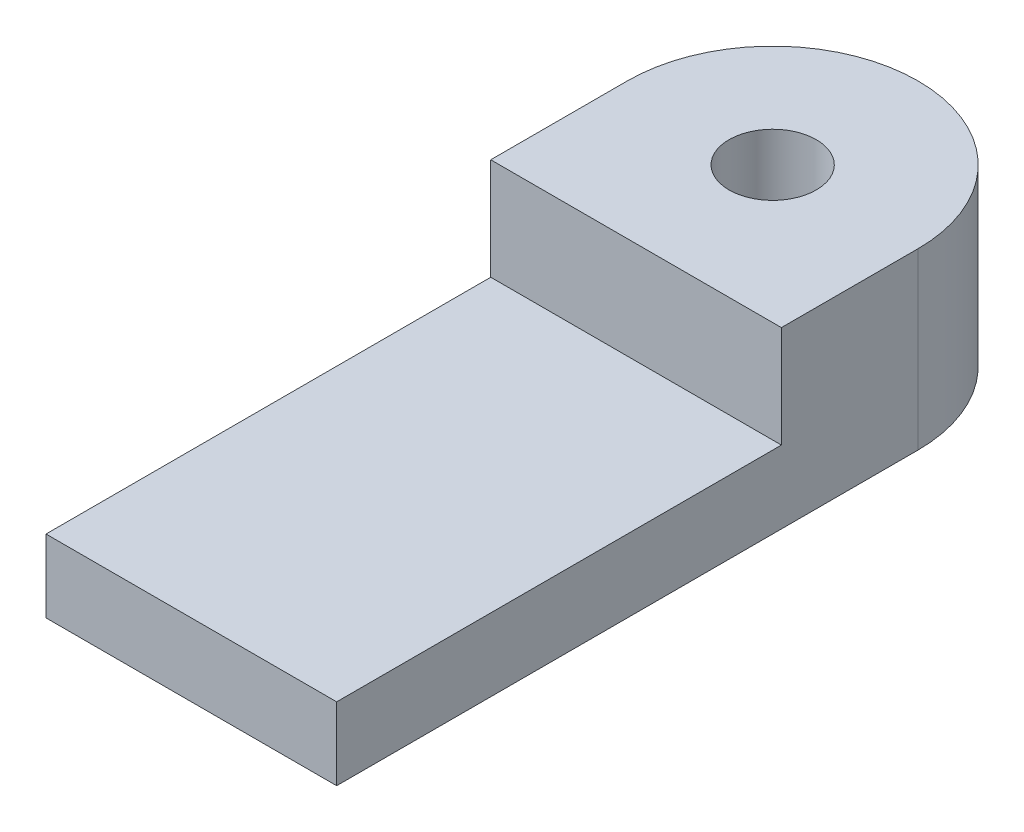
ISO-10303-21;
HEADER;
FILE_DESCRIPTION(('STEP AP214'),'2;1');
FILE_NAME('part.step','',(''),(''),'','','');
FILE_SCHEMA(('AUTOMOTIVE_DESIGN { 1 0 10303 214 1 1 1 1 }'));
ENDSEC;
DATA;
#1=APPLICATION_CONTEXT('core data for automotive mechanical design processes');
#2=APPLICATION_PROTOCOL_DEFINITION('international standard','automotive_design',2000,#1);
#3=PRODUCT_CONTEXT('',#1,'mechanical');
#4=PRODUCT('Part','Part','',(#3));
#5=PRODUCT_RELATED_PRODUCT_CATEGORY('part','',(#4));
#6=PRODUCT_DEFINITION_FORMATION('','',#4);
#7=PRODUCT_DEFINITION_CONTEXT('part definition',#1,'design');
#8=PRODUCT_DEFINITION('design','',#6,#7);
#9=PRODUCT_DEFINITION_SHAPE('','',#8);
#10=(LENGTH_UNIT() NAMED_UNIT(*) SI_UNIT(.MILLI.,.METRE.));
#11=(NAMED_UNIT(*) PLANE_ANGLE_UNIT() SI_UNIT($,.RADIAN.));
#12=(NAMED_UNIT(*) SI_UNIT($,.STERADIAN.) SOLID_ANGLE_UNIT());
#13=UNCERTAINTY_MEASURE_WITH_UNIT(LENGTH_MEASURE(1.E-05),#10,'distance_accuracy_value','');
#14=(GEOMETRIC_REPRESENTATION_CONTEXT(3) GLOBAL_UNCERTAINTY_ASSIGNED_CONTEXT((#13)) GLOBAL_UNIT_ASSIGNED_CONTEXT((#10,
#11,#12)) REPRESENTATION_CONTEXT('',''));
#15=CARTESIAN_POINT('',(0.,0.,0.));
#16=DIRECTION('',(0.,0.,1.));
#17=DIRECTION('',(1.,0.,0.));
#18=AXIS2_PLACEMENT_3D('',#15,#16,#17);
#19=CARTESIAN_POINT('',(5.,2.5,-20.));
#20=DIRECTION('',(0.,-1.,0.));
#21=DIRECTION('',(0.,0.,-1.));
#22=AXIS2_PLACEMENT_3D('',#19,#20,#21);
#23=PLANE('',#22);
#24=DIRECTION('',(1.,0.,0.));
#25=VECTOR('',#24,1.);
#26=CARTESIAN_POINT('',(0.,2.5,-15.3));
#27=LINE('',#26,#25);
#28=CARTESIAN_POINT('',(0.,2.5,-15.3));
#29=VERTEX_POINT('',#28);
#30=CARTESIAN_POINT('',(10.,2.5,-15.3));
#31=VERTEX_POINT('',#30);
#32=EDGE_CURVE('E59',#29,#31,#27,.T.);
#33=ORIENTED_EDGE('',*,*,#32,.F.);
#34=DIRECTION('',(0.,0.,1.));
#35=VECTOR('',#34,1.);
#36=CARTESIAN_POINT('',(0.,2.5,0.));
#37=LINE('',#36,#35);
#38=CARTESIAN_POINT('',(0.,2.5,0.));
#39=VERTEX_POINT('',#38);
#40=EDGE_CURVE('E64',#29,#39,#37,.T.);
#41=ORIENTED_EDGE('',*,*,#40,.T.);
#42=DIRECTION('',(1.,0.,0.));
#43=VECTOR('',#42,1.);
#44=CARTESIAN_POINT('',(10.,2.5,0.));
#45=LINE('',#44,#43);
#46=CARTESIAN_POINT('',(10.,2.5,0.));
#47=VERTEX_POINT('',#46);
#48=EDGE_CURVE('E96',#39,#47,#45,.T.);
#49=ORIENTED_EDGE('',*,*,#48,.T.);
#50=DIRECTION('',(0.,0.,-1.));
#51=VECTOR('',#50,1.);
#52=CARTESIAN_POINT('',(10.,2.5,-20.));
#53=LINE('',#52,#51);
#54=EDGE_CURVE('E159',#47,#31,#53,.T.);
#55=ORIENTED_EDGE('',*,*,#54,.T.);
#56=EDGE_LOOP('',(#33,#41,#49,#55));
#57=FACE_BOUND('',#56,.T.);
#58=ADVANCED_FACE('F43',(#57),#23,.F.);
#59=CARTESIAN_POINT('',(10.,2.5,0.));
#60=DIRECTION('',(0.,0.,-1.));
#61=DIRECTION('',(-1.,0.,0.));
#62=AXIS2_PLACEMENT_3D('',#59,#60,#61);
#63=PLANE('',#62);
#64=DIRECTION('',(1.,0.,0.));
#65=VECTOR('',#64,1.);
#66=CARTESIAN_POINT('',(10.,0.,0.));
#67=LINE('',#66,#65);
#68=CARTESIAN_POINT('',(0.,0.,0.));
#69=VERTEX_POINT('',#68);
#70=CARTESIAN_POINT('',(10.,0.,0.));
#71=VERTEX_POINT('',#70);
#72=EDGE_CURVE('E102',#69,#71,#67,.T.);
#73=ORIENTED_EDGE('',*,*,#72,.T.);
#74=DIRECTION('',(0.,-1.,0.));
#75=VECTOR('',#74,1.);
#76=CARTESIAN_POINT('',(10.,2.5,0.));
#77=LINE('',#76,#75);
#78=EDGE_CURVE('E11',#47,#71,#77,.T.);
#79=ORIENTED_EDGE('',*,*,#78,.F.);
#80=ORIENTED_EDGE('',*,*,#48,.F.);
#81=DIRECTION('',(0.,-1.,0.));
#82=VECTOR('',#81,1.);
#83=CARTESIAN_POINT('',(0.,2.5,0.));
#84=LINE('',#83,#82);
#85=EDGE_CURVE('E87',#39,#69,#84,.T.);
#86=ORIENTED_EDGE('',*,*,#85,.T.);
#87=EDGE_LOOP('',(#73,#79,#80,#86));
#88=FACE_BOUND('',#87,.T.);
#89=ADVANCED_FACE('F45',(#88),#63,.F.);
#90=CARTESIAN_POINT('',(10.,2.5,-20.));
#91=DIRECTION('',(-1.,0.,0.));
#92=DIRECTION('',(0.,0.,1.));
#93=AXIS2_PLACEMENT_3D('',#90,#91,#92);
#94=PLANE('',#93);
#95=DIRECTION('',(0.,0.,-1.));
#96=VECTOR('',#95,1.);
#97=CARTESIAN_POINT('',(10.,0.,-20.));
#98=LINE('',#97,#96);
#99=CARTESIAN_POINT('',(10.,0.,-20.));
#100=VERTEX_POINT('',#99);
#101=EDGE_CURVE('E106',#71,#100,#98,.T.);
#102=ORIENTED_EDGE('',*,*,#101,.T.);
#103=DIRECTION('',(0.,-1.,0.));
#104=VECTOR('',#103,1.);
#105=CARTESIAN_POINT('',(10.,2.5,-20.));
#106=LINE('',#105,#104);
#107=CARTESIAN_POINT('',(10.,6.,-20.));
#108=VERTEX_POINT('',#107);
#109=EDGE_CURVE('E52',#108,#100,#106,.T.);
#110=ORIENTED_EDGE('',*,*,#109,.F.);
#111=DIRECTION('',(0.,0.,-1.));
#112=VECTOR('',#111,1.);
#113=CARTESIAN_POINT('',(10.,6.,-15.3));
#114=LINE('',#113,#112);
#115=CARTESIAN_POINT('',(10.,6.,-15.3));
#116=VERTEX_POINT('',#115);
#117=EDGE_CURVE('E136',#116,#108,#114,.T.);
#118=ORIENTED_EDGE('',*,*,#117,.F.);
#119=DIRECTION('',(0.,-1.,0.));
#120=VECTOR('',#119,1.);
#121=CARTESIAN_POINT('',(10.,6.,-15.3));
#122=LINE('',#121,#120);
#123=EDGE_CURVE('E114',#116,#31,#122,.T.);
#124=ORIENTED_EDGE('',*,*,#123,.T.);
#125=ORIENTED_EDGE('',*,*,#54,.F.);
#126=ORIENTED_EDGE('',*,*,#78,.T.);
#127=EDGE_LOOP('',(#102,#110,#118,#124,#125,#126));
#128=FACE_BOUND('',#127,.T.);
#129=ADVANCED_FACE('F133',(#128),#94,.F.);
#130=CARTESIAN_POINT('',(5.,2.5,-20.));
#131=DIRECTION('',(0.,-1.,0.));
#132=DIRECTION('',(0.,0.,-1.));
#133=AXIS2_PLACEMENT_3D('',#130,#131,#132);
#134=CYLINDRICAL_SURFACE('',#133,5.);
#135=CARTESIAN_POINT('',(5.,0.,-20.));
#136=DIRECTION('',(0.,1.,0.));
#137=DIRECTION('',(0.,0.,-1.));
#138=AXIS2_PLACEMENT_3D('',#135,#136,#137);
#139=CIRCLE('',#138,5.);
#140=CARTESIAN_POINT('',(0.,0.,-20.));
#141=VERTEX_POINT('',#140);
#142=EDGE_CURVE('E97',#100,#141,#139,.T.);
#143=ORIENTED_EDGE('',*,*,#142,.T.);
#144=DIRECTION('',(0.,-1.,0.));
#145=VECTOR('',#144,1.);
#146=CARTESIAN_POINT('',(0.,2.5,-20.));
#147=LINE('',#146,#145);
#148=CARTESIAN_POINT('',(0.,6.,-20.));
#149=VERTEX_POINT('',#148);
#150=EDGE_CURVE('E91',#149,#141,#147,.T.);
#151=ORIENTED_EDGE('',*,*,#150,.F.);
#152=CARTESIAN_POINT('',(5.,6.,-20.));
#153=DIRECTION('',(0.,1.,0.));
#154=DIRECTION('',(0.,0.,1.));
#155=AXIS2_PLACEMENT_3D('',#152,#153,#154);
#156=CIRCLE('',#155,5.);
#157=EDGE_CURVE('E129',#108,#149,#156,.T.);
#158=ORIENTED_EDGE('',*,*,#157,.F.);
#159=ORIENTED_EDGE('',*,*,#109,.T.);
#160=EDGE_LOOP('',(#143,#151,#158,#159));
#161=FACE_BOUND('',#160,.T.);
#162=ADVANCED_FACE('F127',(#161),#134,.T.);
#163=CARTESIAN_POINT('',(0.,2.5,0.));
#164=DIRECTION('',(1.,0.,0.));
#165=DIRECTION('',(0.,0.,-1.));
#166=AXIS2_PLACEMENT_3D('',#163,#164,#165);
#167=PLANE('',#166);
#168=DIRECTION('',(0.,0.,1.));
#169=VECTOR('',#168,1.);
#170=CARTESIAN_POINT('',(0.,0.,0.));
#171=LINE('',#170,#169);
#172=EDGE_CURVE('E84',#141,#69,#171,.T.);
#173=ORIENTED_EDGE('',*,*,#172,.T.);
#174=ORIENTED_EDGE('',*,*,#85,.F.);
#175=ORIENTED_EDGE('',*,*,#40,.F.);
#176=DIRECTION('',(0.,-1.,0.));
#177=VECTOR('',#176,1.);
#178=CARTESIAN_POINT('',(0.,6.,-15.3));
#179=LINE('',#178,#177);
#180=CARTESIAN_POINT('',(0.,6.,-15.3));
#181=VERTEX_POINT('',#180);
#182=EDGE_CURVE('E108',#181,#29,#179,.T.);
#183=ORIENTED_EDGE('',*,*,#182,.F.);
#184=DIRECTION('',(0.,0.,1.));
#185=VECTOR('',#184,1.);
#186=CARTESIAN_POINT('',(0.,6.,-20.));
#187=LINE('',#186,#185);
#188=EDGE_CURVE('E151',#149,#181,#187,.T.);
#189=ORIENTED_EDGE('',*,*,#188,.F.);
#190=ORIENTED_EDGE('',*,*,#150,.T.);
#191=EDGE_LOOP('',(#173,#174,#175,#183,#189,#190));
#192=FACE_BOUND('',#191,.T.);
#193=ADVANCED_FACE('F86',(#192),#167,.F.);
#194=CARTESIAN_POINT('',(5.,0.,-20.));
#195=DIRECTION('',(0.,-1.,0.));
#196=DIRECTION('',(0.,0.,-1.));
#197=AXIS2_PLACEMENT_3D('',#194,#195,#196);
#198=PLANE('',#197);
#199=CARTESIAN_POINT('',(5.,0.,-20.));
#200=DIRECTION('',(0.,1.,0.));
#201=DIRECTION('',(0.,0.,1.));
#202=AXIS2_PLACEMENT_3D('',#199,#200,#201);
#203=CIRCLE('',#202,1.5);
#204=CARTESIAN_POINT('',(5.,0.,-18.5));
#205=VERTEX_POINT('',#204);
#206=EDGE_CURVE('E156',#205,#205,#203,.T.);
#207=ORIENTED_EDGE('',*,*,#206,.T.);
#208=EDGE_LOOP('',(#207));
#209=FACE_BOUND('',#208,.T.);
#210=ORIENTED_EDGE('',*,*,#72,.F.);
#211=ORIENTED_EDGE('',*,*,#172,.F.);
#212=ORIENTED_EDGE('',*,*,#142,.F.);
#213=ORIENTED_EDGE('',*,*,#101,.F.);
#214=EDGE_LOOP('',(#210,#211,#212,#213));
#215=FACE_BOUND('',#214,.T.);
#216=ADVANCED_FACE('F105',(#209,#215),#198,.T.);
#217=CARTESIAN_POINT('',(0.,6.,-15.3));
#218=DIRECTION('',(0.,0.,-1.));
#219=DIRECTION('',(-1.,0.,0.));
#220=AXIS2_PLACEMENT_3D('',#217,#218,#219);
#221=PLANE('',#220);
#222=ORIENTED_EDGE('',*,*,#32,.T.);
#223=ORIENTED_EDGE('',*,*,#123,.F.);
#224=DIRECTION('',(1.,0.,0.));
#225=VECTOR('',#224,1.);
#226=CARTESIAN_POINT('',(0.,6.,-15.3));
#227=LINE('',#226,#225);
#228=EDGE_CURVE('E144',#181,#116,#227,.T.);
#229=ORIENTED_EDGE('',*,*,#228,.F.);
#230=ORIENTED_EDGE('',*,*,#182,.T.);
#231=EDGE_LOOP('',(#222,#223,#229,#230));
#232=FACE_BOUND('',#231,.T.);
#233=ADVANCED_FACE('F164',(#232),#221,.F.);
#234=CARTESIAN_POINT('',(5.,6.,-20.));
#235=DIRECTION('',(0.,1.,0.));
#236=DIRECTION('',(0.,0.,1.));
#237=AXIS2_PLACEMENT_3D('',#234,#235,#236);
#238=PLANE('',#237);
#239=CARTESIAN_POINT('',(5.,6.,-20.));
#240=DIRECTION('',(0.,1.,0.));
#241=DIRECTION('',(0.,0.,1.));
#242=AXIS2_PLACEMENT_3D('',#239,#240,#241);
#243=CIRCLE('',#242,1.5);
#244=CARTESIAN_POINT('',(5.,6.,-18.5));
#245=VERTEX_POINT('',#244);
#246=EDGE_CURVE('E174',#245,#245,#243,.T.);
#247=ORIENTED_EDGE('',*,*,#246,.F.);
#248=EDGE_LOOP('',(#247));
#249=FACE_BOUND('',#248,.T.);
#250=ORIENTED_EDGE('',*,*,#157,.T.);
#251=ORIENTED_EDGE('',*,*,#188,.T.);
#252=ORIENTED_EDGE('',*,*,#228,.T.);
#253=ORIENTED_EDGE('',*,*,#117,.T.);
#254=EDGE_LOOP('',(#250,#251,#252,#253));
#255=FACE_BOUND('',#254,.T.);
#256=ADVANCED_FACE('F140',(#249,#255),#238,.T.);
#257=CARTESIAN_POINT('',(5.,0.,-20.));
#258=DIRECTION('',(0.,1.,0.));
#259=DIRECTION('',(0.,0.,1.));
#260=AXIS2_PLACEMENT_3D('',#257,#258,#259);
#261=CYLINDRICAL_SURFACE('',#260,1.5);
#262=ORIENTED_EDGE('',*,*,#206,.F.);
#263=EDGE_LOOP('',(#262));
#264=FACE_BOUND('',#263,.T.);
#265=ORIENTED_EDGE('',*,*,#246,.T.);
#266=EDGE_LOOP('',(#265));
#267=FACE_BOUND('',#266,.T.);
#268=ADVANCED_FACE('F183',(#264,#267),#261,.F.);
#269=CLOSED_SHELL('',(#58,#89,#129,#162,#193,#216,#233,#256,#268));
#270=MANIFOLD_SOLID_BREP('B2',#269);
#271=ADVANCED_BREP_SHAPE_REPRESENTATION('',(#18,#270),#14);
#272=SHAPE_DEFINITION_REPRESENTATION(#9,#271);
ENDSEC;
END-ISO-10303-21;
